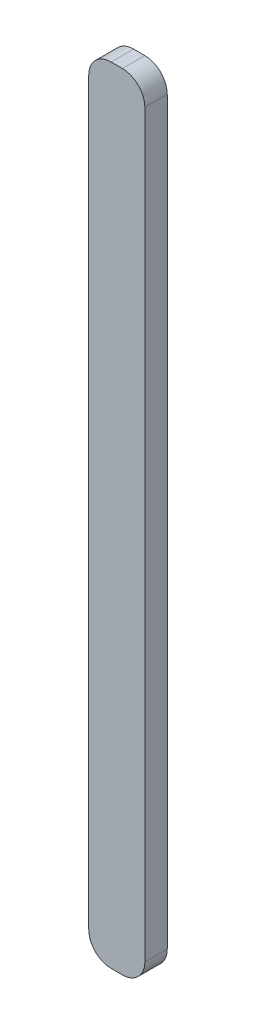
ISO-10303-21;
HEADER;
FILE_DESCRIPTION(('STEP AP214'),'2;1');
FILE_NAME('part.step','',(''),(''),'','','');
FILE_SCHEMA(('AUTOMOTIVE_DESIGN { 1 0 10303 214 1 1 1 1 }'));
ENDSEC;
DATA;
#1=APPLICATION_CONTEXT('core data for automotive mechanical design processes');
#2=APPLICATION_PROTOCOL_DEFINITION('international standard','automotive_design',2000,#1);
#3=PRODUCT_CONTEXT('',#1,'mechanical');
#4=PRODUCT('Part','Part','',(#3));
#5=PRODUCT_RELATED_PRODUCT_CATEGORY('part','',(#4));
#6=PRODUCT_DEFINITION_FORMATION('','',#4);
#7=PRODUCT_DEFINITION_CONTEXT('part definition',#1,'design');
#8=PRODUCT_DEFINITION('design','',#6,#7);
#9=PRODUCT_DEFINITION_SHAPE('','',#8);
#10=(LENGTH_UNIT() NAMED_UNIT(*) SI_UNIT(.MILLI.,.METRE.));
#11=(NAMED_UNIT(*) PLANE_ANGLE_UNIT() SI_UNIT($,.RADIAN.));
#12=(NAMED_UNIT(*) SI_UNIT($,.STERADIAN.) SOLID_ANGLE_UNIT());
#13=UNCERTAINTY_MEASURE_WITH_UNIT(LENGTH_MEASURE(1.E-05),#10,'distance_accuracy_value','');
#14=(GEOMETRIC_REPRESENTATION_CONTEXT(3) GLOBAL_UNCERTAINTY_ASSIGNED_CONTEXT((#13)) GLOBAL_UNIT_ASSIGNED_CONTEXT((#10,
#11,#12)) REPRESENTATION_CONTEXT('',''));
#15=CARTESIAN_POINT('',(0.,0.,0.));
#16=DIRECTION('',(0.,0.,1.));
#17=DIRECTION('',(1.,0.,0.));
#18=AXIS2_PLACEMENT_3D('',#15,#16,#17);
#19=CARTESIAN_POINT('',(0.25,-16.5,1.));
#20=DIRECTION('',(0.,0.,-1.));
#21=DIRECTION('',(-1.,0.,0.));
#22=AXIS2_PLACEMENT_3D('',#19,#20,#21);
#23=CYLINDRICAL_SURFACE('',#22,1.);
#24=CARTESIAN_POINT('',(0.25,-16.5,0.));
#25=DIRECTION('',(0.,0.,1.));
#26=DIRECTION('',(1.,0.,0.));
#27=AXIS2_PLACEMENT_3D('',#24,#25,#26);
#28=CIRCLE('',#27,1.);
#29=CARTESIAN_POINT('',(0.249999999999993,-17.5,0.));
#30=VERTEX_POINT('',#29);
#31=CARTESIAN_POINT('',(1.25,-16.5,0.));
#32=VERTEX_POINT('',#31);
#33=EDGE_CURVE('E128',#30,#32,#28,.T.);
#34=ORIENTED_EDGE('',*,*,#33,.T.);
#35=DIRECTION('',(0.,0.,-1.));
#36=VECTOR('',#35,1.);
#37=CARTESIAN_POINT('',(1.25,-16.5,1.));
#38=LINE('',#37,#36);
#39=CARTESIAN_POINT('',(1.25,-16.5,1.));
#40=VERTEX_POINT('',#39);
#41=EDGE_CURVE('E11',#40,#32,#38,.T.);
#42=ORIENTED_EDGE('',*,*,#41,.F.);
#43=CARTESIAN_POINT('',(0.25,-16.5,1.));
#44=DIRECTION('',(0.,0.,1.));
#45=DIRECTION('',(1.,0.,0.));
#46=AXIS2_PLACEMENT_3D('',#43,#44,#45);
#47=CIRCLE('',#46,1.);
#48=CARTESIAN_POINT('',(0.249999999999993,-17.5,1.));
#49=VERTEX_POINT('',#48);
#50=EDGE_CURVE('E142',#49,#40,#47,.T.);
#51=ORIENTED_EDGE('',*,*,#50,.F.);
#52=DIRECTION('',(0.,0.,-1.));
#53=VECTOR('',#52,1.);
#54=CARTESIAN_POINT('',(0.249999999999993,-17.5,1.));
#55=LINE('',#54,#53);
#56=EDGE_CURVE('E124',#49,#30,#55,.T.);
#57=ORIENTED_EDGE('',*,*,#56,.T.);
#58=EDGE_LOOP('',(#34,#42,#51,#57));
#59=FACE_BOUND('',#58,.T.);
#60=ADVANCED_FACE('F32',(#59),#23,.T.);
#61=CARTESIAN_POINT('',(1.25,16.5,1.));
#62=DIRECTION('',(-1.,0.,0.));
#63=DIRECTION('',(0.,-1.,0.));
#64=AXIS2_PLACEMENT_3D('',#61,#62,#63);
#65=PLANE('',#64);
#66=DIRECTION('',(0.,1.,0.));
#67=VECTOR('',#66,1.);
#68=CARTESIAN_POINT('',(1.25,16.5,0.));
#69=LINE('',#68,#67);
#70=CARTESIAN_POINT('',(1.25,16.5,0.));
#71=VERTEX_POINT('',#70);
#72=EDGE_CURVE('E131',#32,#71,#69,.T.);
#73=ORIENTED_EDGE('',*,*,#72,.T.);
#74=DIRECTION('',(0.,0.,-1.));
#75=VECTOR('',#74,1.);
#76=CARTESIAN_POINT('',(1.25,16.5,1.));
#77=LINE('',#76,#75);
#78=CARTESIAN_POINT('',(1.25,16.5,1.));
#79=VERTEX_POINT('',#78);
#80=EDGE_CURVE('E40',#79,#71,#77,.T.);
#81=ORIENTED_EDGE('',*,*,#80,.F.);
#82=DIRECTION('',(0.,1.,0.));
#83=VECTOR('',#82,1.);
#84=CARTESIAN_POINT('',(1.25,16.5,1.));
#85=LINE('',#84,#83);
#86=EDGE_CURVE('E91',#40,#79,#85,.T.);
#87=ORIENTED_EDGE('',*,*,#86,.F.);
#88=ORIENTED_EDGE('',*,*,#41,.T.);
#89=EDGE_LOOP('',(#73,#81,#87,#88));
#90=FACE_BOUND('',#89,.T.);
#91=ADVANCED_FACE('F177',(#90),#65,.F.);
#92=CARTESIAN_POINT('',(0.249999999999996,16.5,1.));
#93=DIRECTION('',(0.,0.,-1.));
#94=DIRECTION('',(-1.,0.,0.));
#95=AXIS2_PLACEMENT_3D('',#92,#93,#94);
#96=CYLINDRICAL_SURFACE('',#95,1.);
#97=CARTESIAN_POINT('',(0.249999999999996,16.5,0.));
#98=DIRECTION('',(0.,0.,1.));
#99=DIRECTION('',(-1.,0.,0.));
#100=AXIS2_PLACEMENT_3D('',#97,#98,#99);
#101=CIRCLE('',#100,1.);
#102=CARTESIAN_POINT('',(0.249999999999989,17.5,0.));
#103=VERTEX_POINT('',#102);
#104=EDGE_CURVE('E133',#71,#103,#101,.T.);
#105=ORIENTED_EDGE('',*,*,#104,.T.);
#106=DIRECTION('',(0.,0.,-1.));
#107=VECTOR('',#106,1.);
#108=CARTESIAN_POINT('',(0.249999999999989,17.5,1.));
#109=LINE('',#108,#107);
#110=CARTESIAN_POINT('',(0.249999999999989,17.5,1.));
#111=VERTEX_POINT('',#110);
#112=EDGE_CURVE('E149',#111,#103,#109,.T.);
#113=ORIENTED_EDGE('',*,*,#112,.F.);
#114=CARTESIAN_POINT('',(0.249999999999996,16.5,1.));
#115=DIRECTION('',(0.,0.,1.));
#116=DIRECTION('',(-1.,0.,0.));
#117=AXIS2_PLACEMENT_3D('',#114,#115,#116);
#118=CIRCLE('',#117,1.);
#119=EDGE_CURVE('E157',#79,#111,#118,.T.);
#120=ORIENTED_EDGE('',*,*,#119,.F.);
#121=ORIENTED_EDGE('',*,*,#80,.T.);
#122=EDGE_LOOP('',(#105,#113,#120,#121));
#123=FACE_BOUND('',#122,.T.);
#124=ADVANCED_FACE('F155',(#123),#96,.T.);
#125=CARTESIAN_POINT('',(-0.249999999999996,17.5,1.));
#126=DIRECTION('',(0.,-1.,0.));
#127=DIRECTION('',(0.,0.,-1.));
#128=AXIS2_PLACEMENT_3D('',#125,#126,#127);
#129=PLANE('',#128);
#130=DIRECTION('',(-1.,0.,0.));
#131=VECTOR('',#130,1.);
#132=CARTESIAN_POINT('',(-0.249999999999996,17.5,0.));
#133=LINE('',#132,#131);
#134=CARTESIAN_POINT('',(-0.249999999999996,17.5,0.));
#135=VERTEX_POINT('',#134);
#136=EDGE_CURVE('E135',#103,#135,#133,.T.);
#137=ORIENTED_EDGE('',*,*,#136,.T.);
#138=DIRECTION('',(0.,0.,-1.));
#139=VECTOR('',#138,1.);
#140=CARTESIAN_POINT('',(-0.249999999999996,17.5,1.));
#141=LINE('',#140,#139);
#142=CARTESIAN_POINT('',(-0.249999999999996,17.5,1.));
#143=VERTEX_POINT('',#142);
#144=EDGE_CURVE('E146',#143,#135,#141,.T.);
#145=ORIENTED_EDGE('',*,*,#144,.F.);
#146=DIRECTION('',(-1.,0.,0.));
#147=VECTOR('',#146,1.);
#148=CARTESIAN_POINT('',(-0.249999999999996,17.5,1.));
#149=LINE('',#148,#147);
#150=EDGE_CURVE('E169',#111,#143,#149,.T.);
#151=ORIENTED_EDGE('',*,*,#150,.F.);
#152=ORIENTED_EDGE('',*,*,#112,.T.);
#153=EDGE_LOOP('',(#137,#145,#151,#152));
#154=FACE_BOUND('',#153,.T.);
#155=ADVANCED_FACE('F165',(#154),#129,.F.);
#156=CARTESIAN_POINT('',(-0.250000000000003,16.5,1.));
#157=DIRECTION('',(0.,0.,-1.));
#158=DIRECTION('',(-1.,0.,0.));
#159=AXIS2_PLACEMENT_3D('',#156,#157,#158);
#160=CYLINDRICAL_SURFACE('',#159,1.);
#161=CARTESIAN_POINT('',(-0.250000000000003,16.5,0.));
#162=DIRECTION('',(0.,0.,1.));
#163=DIRECTION('',(1.,0.,0.));
#164=AXIS2_PLACEMENT_3D('',#161,#162,#163);
#165=CIRCLE('',#164,1.);
#166=CARTESIAN_POINT('',(-1.25,16.5,0.));
#167=VERTEX_POINT('',#166);
#168=EDGE_CURVE('E137',#135,#167,#165,.T.);
#169=ORIENTED_EDGE('',*,*,#168,.T.);
#170=DIRECTION('',(0.,0.,-1.));
#171=VECTOR('',#170,1.);
#172=CARTESIAN_POINT('',(-1.25,16.5,1.));
#173=LINE('',#172,#171);
#174=CARTESIAN_POINT('',(-1.25,16.5,1.));
#175=VERTEX_POINT('',#174);
#176=EDGE_CURVE('E119',#175,#167,#173,.T.);
#177=ORIENTED_EDGE('',*,*,#176,.F.);
#178=CARTESIAN_POINT('',(-0.250000000000003,16.5,1.));
#179=DIRECTION('',(0.,0.,1.));
#180=DIRECTION('',(1.,0.,0.));
#181=AXIS2_PLACEMENT_3D('',#178,#179,#180);
#182=CIRCLE('',#181,1.);
#183=EDGE_CURVE('E110',#143,#175,#182,.T.);
#184=ORIENTED_EDGE('',*,*,#183,.F.);
#185=ORIENTED_EDGE('',*,*,#144,.T.);
#186=EDGE_LOOP('',(#169,#177,#184,#185));
#187=FACE_BOUND('',#186,.T.);
#188=ADVANCED_FACE('F168',(#187),#160,.T.);
#189=CARTESIAN_POINT('',(-1.25,16.5,1.));
#190=DIRECTION('',(1.,0.,0.));
#191=DIRECTION('',(0.,1.,0.));
#192=AXIS2_PLACEMENT_3D('',#189,#190,#191);
#193=PLANE('',#192);
#194=DIRECTION('',(0.,-1.,0.));
#195=VECTOR('',#194,1.);
#196=CARTESIAN_POINT('',(-1.25,16.5,0.));
#197=LINE('',#196,#195);
#198=CARTESIAN_POINT('',(-1.25,-16.5,0.));
#199=VERTEX_POINT('',#198);
#200=EDGE_CURVE('E118',#167,#199,#197,.T.);
#201=ORIENTED_EDGE('',*,*,#200,.T.);
#202=DIRECTION('',(0.,0.,-1.));
#203=VECTOR('',#202,1.);
#204=CARTESIAN_POINT('',(-1.25,-16.5,1.));
#205=LINE('',#204,#203);
#206=CARTESIAN_POINT('',(-1.25,-16.5,1.));
#207=VERTEX_POINT('',#206);
#208=EDGE_CURVE('E115',#207,#199,#205,.T.);
#209=ORIENTED_EDGE('',*,*,#208,.F.);
#210=DIRECTION('',(0.,-1.,0.));
#211=VECTOR('',#210,1.);
#212=CARTESIAN_POINT('',(-1.25,16.5,1.));
#213=LINE('',#212,#211);
#214=EDGE_CURVE('E104',#175,#207,#213,.T.);
#215=ORIENTED_EDGE('',*,*,#214,.F.);
#216=ORIENTED_EDGE('',*,*,#176,.T.);
#217=EDGE_LOOP('',(#201,#209,#215,#216));
#218=FACE_BOUND('',#217,.T.);
#219=ADVANCED_FACE('F116',(#218),#193,.F.);
#220=CARTESIAN_POINT('',(-0.249999999999998,-16.5,1.));
#221=DIRECTION('',(0.,0.,-1.));
#222=DIRECTION('',(-1.,0.,0.));
#223=AXIS2_PLACEMENT_3D('',#220,#221,#222);
#224=CYLINDRICAL_SURFACE('',#223,1.);
#225=CARTESIAN_POINT('',(-0.249999999999998,-16.5,0.));
#226=DIRECTION('',(0.,0.,1.));
#227=DIRECTION('',(1.,0.,0.));
#228=AXIS2_PLACEMENT_3D('',#225,#226,#227);
#229=CIRCLE('',#228,1.);
#230=CARTESIAN_POINT('',(-0.249999999999991,-17.5,0.));
#231=VERTEX_POINT('',#230);
#232=EDGE_CURVE('E77',#199,#231,#229,.T.);
#233=ORIENTED_EDGE('',*,*,#232,.T.);
#234=DIRECTION('',(0.,0.,-1.));
#235=VECTOR('',#234,1.);
#236=CARTESIAN_POINT('',(-0.249999999999991,-17.5,1.));
#237=LINE('',#236,#235);
#238=CARTESIAN_POINT('',(-0.249999999999991,-17.5,1.));
#239=VERTEX_POINT('',#238);
#240=EDGE_CURVE('E120',#239,#231,#237,.T.);
#241=ORIENTED_EDGE('',*,*,#240,.F.);
#242=CARTESIAN_POINT('',(-0.249999999999998,-16.5,1.));
#243=DIRECTION('',(0.,0.,1.));
#244=DIRECTION('',(1.,0.,0.));
#245=AXIS2_PLACEMENT_3D('',#242,#243,#244);
#246=CIRCLE('',#245,1.);
#247=EDGE_CURVE('E108',#207,#239,#246,.T.);
#248=ORIENTED_EDGE('',*,*,#247,.F.);
#249=ORIENTED_EDGE('',*,*,#208,.T.);
#250=EDGE_LOOP('',(#233,#241,#248,#249));
#251=FACE_BOUND('',#250,.T.);
#252=ADVANCED_FACE('F122',(#251),#224,.T.);
#253=CARTESIAN_POINT('',(-0.249999999999991,-17.5,1.));
#254=DIRECTION('',(0.,1.,0.));
#255=DIRECTION('',(0.,0.,1.));
#256=AXIS2_PLACEMENT_3D('',#253,#254,#255);
#257=PLANE('',#256);
#258=DIRECTION('',(1.,0.,0.));
#259=VECTOR('',#258,1.);
#260=CARTESIAN_POINT('',(-0.249999999999991,-17.5,0.));
#261=LINE('',#260,#259);
#262=EDGE_CURVE('E83',#231,#30,#261,.T.);
#263=ORIENTED_EDGE('',*,*,#262,.T.);
#264=ORIENTED_EDGE('',*,*,#56,.F.);
#265=DIRECTION('',(1.,0.,0.));
#266=VECTOR('',#265,1.);
#267=CARTESIAN_POINT('',(-0.249999999999991,-17.5,1.));
#268=LINE('',#267,#266);
#269=EDGE_CURVE('E48',#239,#49,#268,.T.);
#270=ORIENTED_EDGE('',*,*,#269,.F.);
#271=ORIENTED_EDGE('',*,*,#240,.T.);
#272=EDGE_LOOP('',(#263,#264,#270,#271));
#273=FACE_BOUND('',#272,.T.);
#274=ADVANCED_FACE('F193',(#273),#257,.F.);
#275=CARTESIAN_POINT('',(0.25,-16.5,1.));
#276=DIRECTION('',(0.,0.,1.));
#277=DIRECTION('',(1.,0.,0.));
#278=AXIS2_PLACEMENT_3D('',#275,#276,#277);
#279=PLANE('',#278);
#280=ORIENTED_EDGE('',*,*,#50,.T.);
#281=ORIENTED_EDGE('',*,*,#86,.T.);
#282=ORIENTED_EDGE('',*,*,#119,.T.);
#283=ORIENTED_EDGE('',*,*,#150,.T.);
#284=ORIENTED_EDGE('',*,*,#183,.T.);
#285=ORIENTED_EDGE('',*,*,#214,.T.);
#286=ORIENTED_EDGE('',*,*,#247,.T.);
#287=ORIENTED_EDGE('',*,*,#269,.T.);
#288=EDGE_LOOP('',(#280,#281,#282,#283,#284,#285,#286,#287));
#289=FACE_BOUND('',#288,.T.);
#290=ADVANCED_FACE('F106',(#289),#279,.T.);
#291=CARTESIAN_POINT('',(0.25,-16.5,0.));
#292=DIRECTION('',(0.,0.,1.));
#293=DIRECTION('',(1.,0.,0.));
#294=AXIS2_PLACEMENT_3D('',#291,#292,#293);
#295=PLANE('',#294);
#296=ORIENTED_EDGE('',*,*,#33,.F.);
#297=ORIENTED_EDGE('',*,*,#262,.F.);
#298=ORIENTED_EDGE('',*,*,#232,.F.);
#299=ORIENTED_EDGE('',*,*,#200,.F.);
#300=ORIENTED_EDGE('',*,*,#168,.F.);
#301=ORIENTED_EDGE('',*,*,#136,.F.);
#302=ORIENTED_EDGE('',*,*,#104,.F.);
#303=ORIENTED_EDGE('',*,*,#72,.F.);
#304=EDGE_LOOP('',(#296,#297,#298,#299,#300,#301,#302,#303));
#305=FACE_BOUND('',#304,.T.);
#306=ADVANCED_FACE('F161',(#305),#295,.F.);
#307=CLOSED_SHELL('',(#60,#91,#124,#155,#188,#219,#252,#274,#290,#306));
#308=MANIFOLD_SOLID_BREP('B2',#307);
#309=ADVANCED_BREP_SHAPE_REPRESENTATION('',(#18,#308),#14);
#310=SHAPE_DEFINITION_REPRESENTATION(#9,#309);
ENDSEC;
END-ISO-10303-21;
